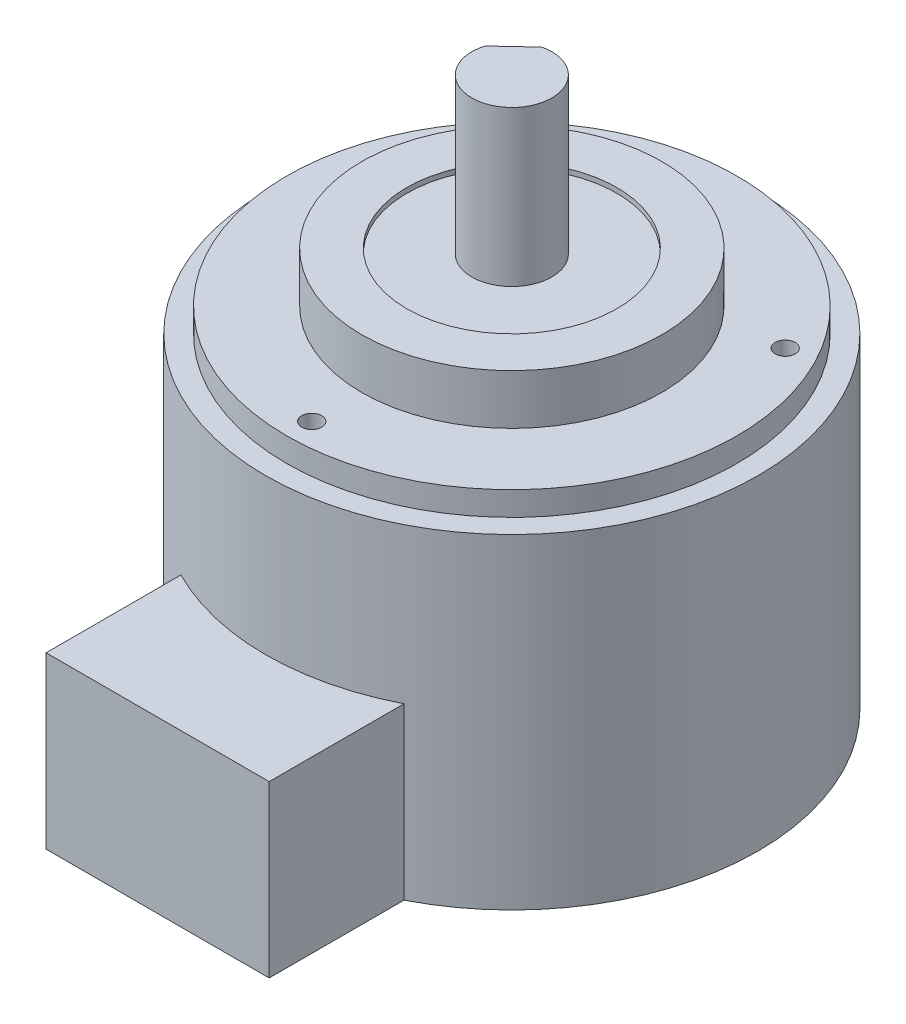
ISO-10303-21;
HEADER;
FILE_DESCRIPTION(('STEP AP214'),'2;1');
FILE_NAME('part.step','',(''),(''),'','','');
FILE_SCHEMA(('AUTOMOTIVE_DESIGN { 1 0 10303 214 1 1 1 1 }'));
ENDSEC;
DATA;
#1=APPLICATION_CONTEXT('core data for automotive mechanical design processes');
#2=APPLICATION_PROTOCOL_DEFINITION('international standard','automotive_design',2000,#1);
#3=PRODUCT_CONTEXT('',#1,'mechanical');
#4=PRODUCT('Part','Part','',(#3));
#5=PRODUCT_RELATED_PRODUCT_CATEGORY('part','',(#4));
#6=PRODUCT_DEFINITION_FORMATION('','',#4);
#7=PRODUCT_DEFINITION_CONTEXT('part definition',#1,'design');
#8=PRODUCT_DEFINITION('design','',#6,#7);
#9=PRODUCT_DEFINITION_SHAPE('','',#8);
#10=(LENGTH_UNIT() NAMED_UNIT(*) SI_UNIT(.MILLI.,.METRE.));
#11=(NAMED_UNIT(*) PLANE_ANGLE_UNIT() SI_UNIT($,.RADIAN.));
#12=(NAMED_UNIT(*) SI_UNIT($,.STERADIAN.) SOLID_ANGLE_UNIT());
#13=UNCERTAINTY_MEASURE_WITH_UNIT(LENGTH_MEASURE(1.E-05),#10,'distance_accuracy_value','');
#14=(GEOMETRIC_REPRESENTATION_CONTEXT(3) GLOBAL_UNCERTAINTY_ASSIGNED_CONTEXT((#13)) GLOBAL_UNIT_ASSIGNED_CONTEXT((#10,
#11,#12)) REPRESENTATION_CONTEXT('',''));
#15=CARTESIAN_POINT('',(0.,0.,0.));
#16=DIRECTION('',(0.,0.,1.));
#17=DIRECTION('',(1.,0.,0.));
#18=AXIS2_PLACEMENT_3D('',#15,#16,#17);
#19=CARTESIAN_POINT('',(10.5465056347778,61.8126275540008,55.6345697800967));
#20=DIRECTION('',(0.,-1.,0.));
#21=DIRECTION('',(-0.68351743738477,0.,-0.729934183876161));
#22=AXIS2_PLACEMENT_3D('',#19,#20,#21);
#23=CYLINDRICAL_SURFACE('',#22,4.);
#24=CARTESIAN_POINT('',(10.5465056347778,61.8126275540008,55.6345697800967));
#25=DIRECTION('',(0.,1.,0.));
#26=DIRECTION('',(0.68351743738477,0.,0.729934183876161));
#27=AXIS2_PLACEMENT_3D('',#24,#25,#26);
#28=CIRCLE('',#27,4.);
#29=CARTESIAN_POINT('',(6.71886340820608,61.8126275540008,54.4730384695566));
#30=VERTEX_POINT('',#29);
#31=CARTESIAN_POINT('',(9.63860014371072,61.8126275540008,51.7389687200175));
#32=VERTEX_POINT('',#31);
#33=EDGE_CURVE('P0_E11',#30,#32,#28,.T.);
#34=ORIENTED_EDGE('',*,*,#33,.F.);
#35=DIRECTION('',(0.,1.,0.));
#36=VECTOR('',#35,1.);
#37=CARTESIAN_POINT('',(6.71886340820608,51.6126275540008,54.4730384695566));
#38=LINE('',#37,#36);
#39=CARTESIAN_POINT('',(6.71886340820608,51.6126275540008,54.4730384695566));
#40=VERTEX_POINT('',#39);
#41=EDGE_CURVE('P0_E30',#40,#30,#38,.T.);
#42=ORIENTED_EDGE('',*,*,#41,.F.);
#43=CARTESIAN_POINT('',(10.5465056347778,51.6126275540008,55.6345697800967));
#44=DIRECTION('',(0.,1.,0.));
#45=DIRECTION('',(-0.68351743738477,0.,-0.729934183876161));
#46=AXIS2_PLACEMENT_3D('',#43,#44,#45);
#47=CIRCLE('',#46,4.00000000000001);
#48=CARTESIAN_POINT('',(9.63860014371072,51.6126275540008,51.7389687200175));
#49=VERTEX_POINT('',#48);
#50=EDGE_CURVE('P0_E45',#49,#40,#47,.T.);
#51=ORIENTED_EDGE('',*,*,#50,.F.);
#52=DIRECTION('',(0.,1.,0.));
#53=VECTOR('',#52,1.);
#54=CARTESIAN_POINT('',(9.63860014371072,51.6126275540008,51.7389687200175));
#55=LINE('',#54,#53);
#56=EDGE_CURVE('P0_E36',#49,#32,#55,.T.);
#57=ORIENTED_EDGE('',*,*,#56,.T.);
#58=EDGE_LOOP('',(#34,#42,#51,#57));
#59=FACE_BOUND('',#58,.T.);
#60=CARTESIAN_POINT('',(10.5465056347778,6.91262755400083,55.6345697800967));
#61=DIRECTION('',(0.,1.,0.));
#62=DIRECTION('',(0.68351743738477,0.,0.729934183876161));
#63=AXIS2_PLACEMENT_3D('',#60,#61,#62);
#64=CIRCLE('',#63,4.);
#65=CARTESIAN_POINT('',(13.2805753843169,6.91262755400083,58.5543065156014));
#66=VERTEX_POINT('',#65);
#67=EDGE_CURVE('P0_E19',#66,#66,#64,.T.);
#68=ORIENTED_EDGE('',*,*,#67,.T.);
#69=EDGE_LOOP('',(#68));
#70=FACE_BOUND('',#69,.T.);
#71=ADVANCED_FACE('P0_F16',(#59,#70),#23,.T.);
#72=CARTESIAN_POINT('',(10.5465056347778,61.8126275540008,55.6345697800967));
#73=DIRECTION('',(0.,1.,0.));
#74=DIRECTION('',(0.68351743738477,0.,0.729934183876161));
#75=AXIS2_PLACEMENT_3D('',#72,#73,#74);
#76=PLANE('',#75);
#77=DIRECTION('',(0.729934183876161,0.,-0.68351743738477));
#78=VECTOR('',#77,1.);
#79=CARTESIAN_POINT('',(6.71886340820608,61.8126275540008,54.4730384695566));
#80=LINE('',#79,#78);
#81=EDGE_CURVE('P0_E41',#30,#32,#80,.T.);
#82=ORIENTED_EDGE('',*,*,#81,.F.);
#83=ORIENTED_EDGE('',*,*,#33,.T.);
#84=EDGE_LOOP('',(#82,#83));
#85=FACE_BOUND('',#84,.T.);
#86=ADVANCED_FACE('P0_F51',(#85),#76,.T.);
#87=CARTESIAN_POINT('',(10.5465056347778,6.91262755400083,55.6345697800967));
#88=DIRECTION('',(0.,1.,0.));
#89=DIRECTION('',(0.68351743738477,0.,0.729934183876161));
#90=AXIS2_PLACEMENT_3D('',#87,#88,#89);
#91=PLANE('',#90);
#92=ORIENTED_EDGE('',*,*,#67,.F.);
#93=EDGE_LOOP('',(#92));
#94=FACE_BOUND('',#93,.T.);
#95=ADVANCED_FACE('P0_F53',(#94),#91,.F.);
#96=CARTESIAN_POINT('',(6.71886340820608,51.6126275540008,54.4730384695566));
#97=DIRECTION('',(0.68351743738477,0.,0.729934183876161));
#98=DIRECTION('',(0.729934183876161,0.,-0.68351743738477));
#99=AXIS2_PLACEMENT_3D('',#96,#97,#98);
#100=PLANE('',#99);
#101=ORIENTED_EDGE('',*,*,#81,.T.);
#102=ORIENTED_EDGE('',*,*,#56,.F.);
#103=DIRECTION('',(0.729934183876161,0.,-0.68351743738477));
#104=VECTOR('',#103,1.);
#105=CARTESIAN_POINT('',(6.71886340820608,51.6126275540008,54.4730384695566));
#106=LINE('',#105,#104);
#107=EDGE_CURVE('P0_E69',#40,#49,#106,.T.);
#108=ORIENTED_EDGE('',*,*,#107,.F.);
#109=ORIENTED_EDGE('',*,*,#41,.T.);
#110=EDGE_LOOP('',(#101,#102,#108,#109));
#111=FACE_BOUND('',#110,.T.);
#112=ADVANCED_FACE('P0_F42',(#111),#100,.F.);
#113=CARTESIAN_POINT('',(10.5465056347778,51.6126275540008,55.6345697800967));
#114=DIRECTION('',(0.,-1.,0.));
#115=DIRECTION('',(-0.68351743738477,0.,-0.729934183876161));
#116=AXIS2_PLACEMENT_3D('',#113,#114,#115);
#117=PLANE('',#116);
#118=ORIENTED_EDGE('',*,*,#50,.T.);
#119=ORIENTED_EDGE('',*,*,#107,.T.);
#120=EDGE_LOOP('',(#118,#119));
#121=FACE_BOUND('',#120,.T.);
#122=ADVANCED_FACE('P0_F64',(#121),#117,.F.);
#123=CLOSED_SHELL('',(#71,#86,#95,#112,#122));
#124=MANIFOLD_SOLID_BREP('P0_B1',#123);
#125=CARTESIAN_POINT('',(10.5465056347778,23.9126275540008,55.6345697800967));
#126=DIRECTION('',(0.,-1.,0.));
#127=DIRECTION('',(0.,0.,-1.));
#128=AXIS2_PLACEMENT_3D('',#125,#126,#127);
#129=CYLINDRICAL_SURFACE('',#128,24.6);
#130=CARTESIAN_POINT('',(10.5465056347778,6.91262755400083,55.6345697800967));
#131=DIRECTION('',(0.,1.,0.));
#132=DIRECTION('',(0.,0.,1.));
#133=AXIS2_PLACEMENT_3D('',#130,#131,#132);
#134=CIRCLE('',#133,24.6);
#135=CARTESIAN_POINT('',(-0.603494365222203,6.91262755400083,77.562576985495));
#136=VERTEX_POINT('',#135);
#137=CARTESIAN_POINT('',(21.6965056347778,6.91262755400083,77.562576985495));
#138=VERTEX_POINT('',#137);
#139=EDGE_CURVE('P1_E79',#136,#138,#134,.T.);
#140=ORIENTED_EDGE('',*,*,#139,.F.);
#141=DIRECTION('',(0.,-1.,0.));
#142=VECTOR('',#141,1.);
#143=CARTESIAN_POINT('',(-0.603494365222203,23.9126275540008,77.562576985495));
#144=LINE('',#143,#142);
#145=CARTESIAN_POINT('',(-0.603494365222203,23.9126275540008,77.562576985495));
#146=VERTEX_POINT('',#145);
#147=EDGE_CURVE('P1_E11',#146,#136,#144,.T.);
#148=ORIENTED_EDGE('',*,*,#147,.F.);
#149=CARTESIAN_POINT('',(10.5465056347778,23.9126275540008,55.6345697800967));
#150=DIRECTION('',(0.,1.,0.));
#151=DIRECTION('',(0.,0.,1.));
#152=AXIS2_PLACEMENT_3D('',#149,#150,#151);
#153=CIRCLE('',#152,24.6);
#154=CARTESIAN_POINT('',(21.6965056347778,23.9126275540008,77.562576985495));
#155=VERTEX_POINT('',#154);
#156=EDGE_CURVE('P1_E72',#146,#155,#153,.T.);
#157=ORIENTED_EDGE('',*,*,#156,.T.);
#158=DIRECTION('',(0.,-1.,0.));
#159=VECTOR('',#158,1.);
#160=CARTESIAN_POINT('',(21.6965056347778,23.9126275540008,77.562576985495));
#161=LINE('',#160,#159);
#162=EDGE_CURVE('P1_E54',#155,#138,#161,.T.);
#163=ORIENTED_EDGE('',*,*,#162,.T.);
#164=EDGE_LOOP('',(#140,#148,#157,#163));
#165=FACE_BOUND('',#164,.T.);
#166=ADVANCED_FACE('P1_F16',(#165),#129,.F.);
#167=CARTESIAN_POINT('',(-0.603494365222201,23.9126275540008,55.6345697800967));
#168=DIRECTION('',(-1.,0.,0.));
#169=DIRECTION('',(0.,0.,1.));
#170=AXIS2_PLACEMENT_3D('',#167,#168,#169);
#171=PLANE('',#170);
#172=DIRECTION('',(0.,0.,-1.));
#173=VECTOR('',#172,1.);
#174=CARTESIAN_POINT('',(-0.603494365222201,6.91262755400083,55.6345697800967));
#175=LINE('',#174,#173);
#176=CARTESIAN_POINT('',(-0.603494365222204,6.91262755400083,91.0345697800967));
#177=VERTEX_POINT('',#176);
#178=EDGE_CURVE('P1_E65',#177,#136,#175,.T.);
#179=ORIENTED_EDGE('',*,*,#178,.F.);
#180=DIRECTION('',(0.,-1.,0.));
#181=VECTOR('',#180,1.);
#182=CARTESIAN_POINT('',(-0.603494365222204,23.9126275540008,91.0345697800967));
#183=LINE('',#182,#181);
#184=CARTESIAN_POINT('',(-0.603494365222204,23.9126275540008,91.0345697800967));
#185=VERTEX_POINT('',#184);
#186=EDGE_CURVE('P1_E24',#185,#177,#183,.T.);
#187=ORIENTED_EDGE('',*,*,#186,.F.);
#188=DIRECTION('',(0.,0.,-1.));
#189=VECTOR('',#188,1.);
#190=CARTESIAN_POINT('',(-0.603494365222201,23.9126275540008,55.6345697800967));
#191=LINE('',#190,#189);
#192=EDGE_CURVE('P1_E63',#185,#146,#191,.T.);
#193=ORIENTED_EDGE('',*,*,#192,.T.);
#194=ORIENTED_EDGE('',*,*,#147,.T.);
#195=EDGE_LOOP('',(#179,#187,#193,#194));
#196=FACE_BOUND('',#195,.T.);
#197=ADVANCED_FACE('P1_F62',(#196),#171,.T.);
#198=CARTESIAN_POINT('',(10.5465056347778,23.9126275540008,91.0345697800967));
#199=DIRECTION('',(0.,0.,1.));
#200=DIRECTION('',(1.,0.,0.));
#201=AXIS2_PLACEMENT_3D('',#198,#199,#200);
#202=PLANE('',#201);
#203=DIRECTION('',(-1.,0.,0.));
#204=VECTOR('',#203,1.);
#205=CARTESIAN_POINT('',(10.5465056347778,6.91262755400083,91.0345697800967));
#206=LINE('',#205,#204);
#207=CARTESIAN_POINT('',(21.6965056347778,6.91262755400083,91.0345697800967));
#208=VERTEX_POINT('',#207);
#209=EDGE_CURVE('P1_E83',#208,#177,#206,.T.);
#210=ORIENTED_EDGE('',*,*,#209,.F.);
#211=DIRECTION('',(0.,-1.,0.));
#212=VECTOR('',#211,1.);
#213=CARTESIAN_POINT('',(21.6965056347778,23.9126275540008,91.0345697800967));
#214=LINE('',#213,#212);
#215=CARTESIAN_POINT('',(21.6965056347778,23.9126275540008,91.0345697800967));
#216=VERTEX_POINT('',#215);
#217=EDGE_CURVE('P1_E47',#216,#208,#214,.T.);
#218=ORIENTED_EDGE('',*,*,#217,.F.);
#219=DIRECTION('',(-1.,0.,0.));
#220=VECTOR('',#219,1.);
#221=CARTESIAN_POINT('',(10.5465056347778,23.9126275540008,91.0345697800967));
#222=LINE('',#221,#220);
#223=EDGE_CURVE('P1_E71',#216,#185,#222,.T.);
#224=ORIENTED_EDGE('',*,*,#223,.T.);
#225=ORIENTED_EDGE('',*,*,#186,.T.);
#226=EDGE_LOOP('',(#210,#218,#224,#225));
#227=FACE_BOUND('',#226,.T.);
#228=ADVANCED_FACE('P1_F74',(#227),#202,.T.);
#229=CARTESIAN_POINT('',(21.6965056347778,23.9126275540008,55.6345697800967));
#230=DIRECTION('',(-1.,0.,0.));
#231=DIRECTION('',(0.,0.,1.));
#232=AXIS2_PLACEMENT_3D('',#229,#230,#231);
#233=PLANE('',#232);
#234=DIRECTION('',(0.,0.,-1.));
#235=VECTOR('',#234,1.);
#236=CARTESIAN_POINT('',(21.6965056347778,6.91262755400083,55.6345697800967));
#237=LINE('',#236,#235);
#238=EDGE_CURVE('P1_E85',#208,#138,#237,.T.);
#239=ORIENTED_EDGE('',*,*,#238,.T.);
#240=ORIENTED_EDGE('',*,*,#162,.F.);
#241=DIRECTION('',(0.,0.,-1.));
#242=VECTOR('',#241,1.);
#243=CARTESIAN_POINT('',(21.6965056347778,23.9126275540008,55.6345697800967));
#244=LINE('',#243,#242);
#245=EDGE_CURVE('P1_E32',#216,#155,#244,.T.);
#246=ORIENTED_EDGE('',*,*,#245,.F.);
#247=ORIENTED_EDGE('',*,*,#217,.T.);
#248=EDGE_LOOP('',(#239,#240,#246,#247));
#249=FACE_BOUND('',#248,.T.);
#250=ADVANCED_FACE('P1_F96',(#249),#233,.F.);
#251=CARTESIAN_POINT('',(10.5465056347778,23.9126275540008,55.6345697800967));
#252=DIRECTION('',(0.,1.,0.));
#253=DIRECTION('',(0.,0.,1.));
#254=AXIS2_PLACEMENT_3D('',#251,#252,#253);
#255=PLANE('',#254);
#256=ORIENTED_EDGE('',*,*,#156,.F.);
#257=ORIENTED_EDGE('',*,*,#192,.F.);
#258=ORIENTED_EDGE('',*,*,#223,.F.);
#259=ORIENTED_EDGE('',*,*,#245,.T.);
#260=EDGE_LOOP('',(#256,#257,#258,#259));
#261=FACE_BOUND('',#260,.T.);
#262=ADVANCED_FACE('P1_F70',(#261),#255,.T.);
#263=CARTESIAN_POINT('',(10.5465056347778,6.91262755400083,55.6345697800967));
#264=DIRECTION('',(0.,1.,0.));
#265=DIRECTION('',(0.,0.,1.));
#266=AXIS2_PLACEMENT_3D('',#263,#264,#265);
#267=PLANE('',#266);
#268=ORIENTED_EDGE('',*,*,#139,.T.);
#269=ORIENTED_EDGE('',*,*,#238,.F.);
#270=ORIENTED_EDGE('',*,*,#209,.T.);
#271=ORIENTED_EDGE('',*,*,#178,.T.);
#272=EDGE_LOOP('',(#268,#269,#270,#271));
#273=FACE_BOUND('',#272,.T.);
#274=ADVANCED_FACE('P1_F101',(#273),#267,.F.);
#275=CLOSED_SHELL('',(#166,#197,#228,#250,#262,#274));
#276=MANIFOLD_SOLID_BREP('P1_B1',#275);
#277=CARTESIAN_POINT('',(10.5465056347778,39.4126275540008,55.6345697800967));
#278=DIRECTION('',(0.,-1.,0.));
#279=DIRECTION('',(0.,0.,-1.));
#280=AXIS2_PLACEMENT_3D('',#277,#278,#279);
#281=CYLINDRICAL_SURFACE('',#280,24.6);
#282=CARTESIAN_POINT('',(10.5465056347778,39.4126275540008,55.6345697800967));
#283=DIRECTION('',(0.,1.,0.));
#284=DIRECTION('',(0.,0.,1.));
#285=AXIS2_PLACEMENT_3D('',#282,#283,#284);
#286=CIRCLE('',#285,24.6);
#287=CARTESIAN_POINT('',(10.5465056347778,39.4126275540008,80.2345697800967));
#288=VERTEX_POINT('',#287);
#289=EDGE_CURVE('P2_E20',#288,#288,#286,.T.);
#290=ORIENTED_EDGE('',*,*,#289,.F.);
#291=EDGE_LOOP('',(#290));
#292=FACE_BOUND('',#291,.T.);
#293=CARTESIAN_POINT('',(10.5465056347778,6.91262755400083,55.6345697800967));
#294=DIRECTION('',(0.,1.,0.));
#295=DIRECTION('',(0.,0.,1.));
#296=AXIS2_PLACEMENT_3D('',#293,#294,#295);
#297=CIRCLE('',#296,24.6);
#298=CARTESIAN_POINT('',(10.5465056347778,6.91262755400083,80.2345697800967));
#299=VERTEX_POINT('',#298);
#300=EDGE_CURVE('P2_E29',#299,#299,#297,.T.);
#301=ORIENTED_EDGE('',*,*,#300,.T.);
#302=EDGE_LOOP('',(#301));
#303=FACE_BOUND('',#302,.T.);
#304=ADVANCED_FACE('P2_F14',(#292,#303),#281,.T.);
#305=CARTESIAN_POINT('',(10.5465056347778,39.4126275540008,55.6345697800967));
#306=DIRECTION('',(0.,1.,0.));
#307=DIRECTION('',(0.,0.,1.));
#308=AXIS2_PLACEMENT_3D('',#305,#306,#307);
#309=PLANE('',#308);
#310=CARTESIAN_POINT('',(10.5465056347778,39.4126275540008,55.6345697800967));
#311=DIRECTION('',(0.,1.,0.));
#312=DIRECTION('',(0.,0.,1.));
#313=AXIS2_PLACEMENT_3D('',#310,#311,#312);
#314=CIRCLE('',#313,22.5);
#315=CARTESIAN_POINT('',(10.5465056347778,39.4126275540008,78.1345697800967));
#316=VERTEX_POINT('',#315);
#317=EDGE_CURVE('P2_E24',#316,#316,#314,.T.);
#318=ORIENTED_EDGE('',*,*,#317,.F.);
#319=EDGE_LOOP('',(#318));
#320=FACE_BOUND('',#319,.T.);
#321=ORIENTED_EDGE('',*,*,#289,.T.);
#322=EDGE_LOOP('',(#321));
#323=FACE_BOUND('',#322,.T.);
#324=ADVANCED_FACE('P2_F115',(#320,#323),#309,.T.);
#325=CARTESIAN_POINT('',(10.5465056347778,6.91262755400083,55.6345697800967));
#326=DIRECTION('',(0.,1.,0.));
#327=DIRECTION('',(0.,0.,1.));
#328=AXIS2_PLACEMENT_3D('',#325,#326,#327);
#329=PLANE('',#328);
#330=ORIENTED_EDGE('',*,*,#300,.F.);
#331=EDGE_LOOP('',(#330));
#332=FACE_BOUND('',#331,.T.);
#333=CARTESIAN_POINT('',(10.5465056347778,6.91262755400083,55.6345697800967));
#334=DIRECTION('',(0.,1.,0.));
#335=DIRECTION('',(0.,0.,1.));
#336=AXIS2_PLACEMENT_3D('',#333,#334,#335);
#337=CIRCLE('',#336,4.);
#338=CARTESIAN_POINT('',(10.5465056347778,6.91262755400083,59.6345697800967));
#339=VERTEX_POINT('',#338);
#340=EDGE_CURVE('P2_E50',#339,#339,#337,.T.);
#341=ORIENTED_EDGE('',*,*,#340,.T.);
#342=EDGE_LOOP('',(#341));
#343=FACE_BOUND('',#342,.T.);
#344=ADVANCED_FACE('P2_F121',(#332,#343),#329,.F.);
#345=CARTESIAN_POINT('',(10.5465056347778,41.8126275540008,55.6345697800967));
#346=DIRECTION('',(0.,-1.,0.));
#347=DIRECTION('',(0.,0.,-1.));
#348=AXIS2_PLACEMENT_3D('',#345,#346,#347);
#349=CYLINDRICAL_SURFACE('',#348,22.5);
#350=ORIENTED_EDGE('',*,*,#317,.T.);
#351=EDGE_LOOP('',(#350));
#352=FACE_BOUND('',#351,.T.);
#353=CARTESIAN_POINT('',(10.5465056347778,41.8126275540008,55.6345697800967));
#354=DIRECTION('',(0.,1.,0.));
#355=DIRECTION('',(0.,0.,1.));
#356=AXIS2_PLACEMENT_3D('',#353,#354,#355);
#357=CIRCLE('',#356,22.5);
#358=CARTESIAN_POINT('',(10.5465056347778,41.8126275540008,78.1345697800967));
#359=VERTEX_POINT('',#358);
#360=EDGE_CURVE('P2_E33',#359,#359,#357,.T.);
#361=ORIENTED_EDGE('',*,*,#360,.F.);
#362=EDGE_LOOP('',(#361));
#363=FACE_BOUND('',#362,.T.);
#364=ADVANCED_FACE('P2_F87',(#352,#363),#349,.T.);
#365=CARTESIAN_POINT('',(10.5465056347778,41.8126275540008,55.6345697800967));
#366=DIRECTION('',(0.,1.,0.));
#367=DIRECTION('',(0.,0.,1.));
#368=AXIS2_PLACEMENT_3D('',#365,#366,#367);
#369=PLANE('',#368);
#370=CARTESIAN_POINT('',(27.8670137104666,41.8126275540008,45.6345697800967));
#371=DIRECTION('',(0.,1.,0.));
#372=DIRECTION('',(0.,0.,1.));
#373=AXIS2_PLACEMENT_3D('',#370,#371,#372);
#374=CIRCLE('',#373,1.);
#375=CARTESIAN_POINT('',(27.8670137104666,41.8126275540008,46.6345697800967));
#376=VERTEX_POINT('',#375);
#377=EDGE_CURVE('P2_E68',#376,#376,#374,.T.);
#378=ORIENTED_EDGE('',*,*,#377,.F.);
#379=EDGE_LOOP('',(#378));
#380=FACE_BOUND('',#379,.T.);
#381=CARTESIAN_POINT('',(-6.77400244091098,41.8126275540008,45.6345697800967));
#382=DIRECTION('',(0.,1.,0.));
#383=DIRECTION('',(0.,0.,1.));
#384=AXIS2_PLACEMENT_3D('',#381,#382,#383);
#385=CIRCLE('',#384,1.);
#386=CARTESIAN_POINT('',(-6.77400244091098,41.8126275540008,46.6345697800967));
#387=VERTEX_POINT('',#386);
#388=EDGE_CURVE('P2_E62',#387,#387,#385,.T.);
#389=ORIENTED_EDGE('',*,*,#388,.F.);
#390=EDGE_LOOP('',(#389));
#391=FACE_BOUND('',#390,.T.);
#392=CARTESIAN_POINT('',(10.5465056347778,41.8126275540008,75.6345697800967));
#393=DIRECTION('',(0.,1.,0.));
#394=DIRECTION('',(0.,0.,1.));
#395=AXIS2_PLACEMENT_3D('',#392,#393,#394);
#396=CIRCLE('',#395,1.);
#397=CARTESIAN_POINT('',(10.5465056347778,41.8126275540008,76.6345697800967));
#398=VERTEX_POINT('',#397);
#399=EDGE_CURVE('P2_E56',#398,#398,#396,.T.);
#400=ORIENTED_EDGE('',*,*,#399,.F.);
#401=EDGE_LOOP('',(#400));
#402=FACE_BOUND('',#401,.T.);
#403=CARTESIAN_POINT('',(10.5465056347778,41.8126275540008,55.6345697800967));
#404=DIRECTION('',(0.,1.,0.));
#405=DIRECTION('',(0.,0.,1.));
#406=AXIS2_PLACEMENT_3D('',#403,#404,#405);
#407=CIRCLE('',#406,15.);
#408=CARTESIAN_POINT('',(10.5465056347778,41.8126275540008,70.6345697800967));
#409=VERTEX_POINT('',#408);
#410=EDGE_CURVE('P2_E37',#409,#409,#407,.T.);
#411=ORIENTED_EDGE('',*,*,#410,.F.);
#412=EDGE_LOOP('',(#411));
#413=FACE_BOUND('',#412,.T.);
#414=ORIENTED_EDGE('',*,*,#360,.T.);
#415=EDGE_LOOP('',(#414));
#416=FACE_BOUND('',#415,.T.);
#417=ADVANCED_FACE('P2_F83',(#380,#391,#402,#413,#416),#369,.T.);
#418=CARTESIAN_POINT('',(10.5465056347778,46.8126275540008,55.6345697800967));
#419=DIRECTION('',(0.,-1.,0.));
#420=DIRECTION('',(0.,0.,-1.));
#421=AXIS2_PLACEMENT_3D('',#418,#419,#420);
#422=CYLINDRICAL_SURFACE('',#421,10.5);
#423=CARTESIAN_POINT('',(10.5465056347778,46.3126275540008,55.6345697800967));
#424=DIRECTION('',(0.,1.,0.));
#425=DIRECTION('',(0.,0.,1.));
#426=AXIS2_PLACEMENT_3D('',#423,#424,#425);
#427=CIRCLE('',#426,10.5);
#428=CARTESIAN_POINT('',(10.5465056347778,46.3126275540008,66.1345697800967));
#429=VERTEX_POINT('',#428);
#430=EDGE_CURVE('P2_E10',#429,#429,#427,.T.);
#431=ORIENTED_EDGE('',*,*,#430,.F.);
#432=EDGE_LOOP('',(#431));
#433=FACE_BOUND('',#432,.T.);
#434=CARTESIAN_POINT('',(10.5465056347778,46.8126275540008,55.6345697800967));
#435=DIRECTION('',(0.,1.,0.));
#436=DIRECTION('',(0.,0.,1.));
#437=AXIS2_PLACEMENT_3D('',#434,#435,#436);
#438=CIRCLE('',#437,10.5);
#439=CARTESIAN_POINT('',(10.5465056347778,46.8126275540008,66.1345697800967));
#440=VERTEX_POINT('',#439);
#441=EDGE_CURVE('P2_E46',#440,#440,#438,.T.);
#442=ORIENTED_EDGE('',*,*,#441,.T.);
#443=EDGE_LOOP('',(#442));
#444=FACE_BOUND('',#443,.T.);
#445=ADVANCED_FACE('P2_F86',(#433,#444),#422,.F.);
#446=CARTESIAN_POINT('',(10.5465056347778,46.8126275540008,55.6345697800967));
#447=DIRECTION('',(0.,-1.,0.));
#448=DIRECTION('',(0.,0.,-1.));
#449=AXIS2_PLACEMENT_3D('',#446,#447,#448);
#450=CYLINDRICAL_SURFACE('',#449,15.);
#451=ORIENTED_EDGE('',*,*,#410,.T.);
#452=EDGE_LOOP('',(#451));
#453=FACE_BOUND('',#452,.T.);
#454=CARTESIAN_POINT('',(10.5465056347778,46.8126275540008,55.6345697800967));
#455=DIRECTION('',(0.,1.,0.));
#456=DIRECTION('',(0.,0.,1.));
#457=AXIS2_PLACEMENT_3D('',#454,#455,#456);
#458=CIRCLE('',#457,15.);
#459=CARTESIAN_POINT('',(10.5465056347778,46.8126275540008,70.6345697800967));
#460=VERTEX_POINT('',#459);
#461=EDGE_CURVE('P2_E41',#460,#460,#458,.T.);
#462=ORIENTED_EDGE('',*,*,#461,.F.);
#463=EDGE_LOOP('',(#462));
#464=FACE_BOUND('',#463,.T.);
#465=ADVANCED_FACE('P2_F95',(#453,#464),#450,.T.);
#466=CARTESIAN_POINT('',(10.5465056347778,46.8126275540008,55.6345697800967));
#467=DIRECTION('',(0.,1.,0.));
#468=DIRECTION('',(0.,0.,1.));
#469=AXIS2_PLACEMENT_3D('',#466,#467,#468);
#470=PLANE('',#469);
#471=ORIENTED_EDGE('',*,*,#441,.F.);
#472=EDGE_LOOP('',(#471));
#473=FACE_BOUND('',#472,.T.);
#474=ORIENTED_EDGE('',*,*,#461,.T.);
#475=EDGE_LOOP('',(#474));
#476=FACE_BOUND('',#475,.T.);
#477=ADVANCED_FACE('P2_F98',(#473,#476),#470,.T.);
#478=CARTESIAN_POINT('',(10.5465056347778,46.3126275540008,55.6345697800967));
#479=DIRECTION('',(0.,-1.,0.));
#480=DIRECTION('',(0.,0.,-1.));
#481=AXIS2_PLACEMENT_3D('',#478,#479,#480);
#482=CYLINDRICAL_SURFACE('',#481,4.);
#483=CARTESIAN_POINT('',(10.5465056347778,46.3126275540008,55.6345697800967));
#484=DIRECTION('',(0.,1.,0.));
#485=DIRECTION('',(0.,0.,1.));
#486=AXIS2_PLACEMENT_3D('',#483,#484,#485);
#487=CIRCLE('',#486,4.);
#488=CARTESIAN_POINT('',(10.5465056347778,46.3126275540008,59.6345697800967));
#489=VERTEX_POINT('',#488);
#490=EDGE_CURVE('P2_E49',#489,#489,#487,.T.);
#491=ORIENTED_EDGE('',*,*,#490,.T.);
#492=EDGE_LOOP('',(#491));
#493=FACE_BOUND('',#492,.T.);
#494=ORIENTED_EDGE('',*,*,#340,.F.);
#495=EDGE_LOOP('',(#494));
#496=FACE_BOUND('',#495,.T.);
#497=ADVANCED_FACE('P2_F103',(#493,#496),#482,.F.);
#498=CARTESIAN_POINT('',(10.5465056347778,46.3126275540008,55.6345697800967));
#499=DIRECTION('',(0.,1.,0.));
#500=DIRECTION('',(0.,0.,1.));
#501=AXIS2_PLACEMENT_3D('',#498,#499,#500);
#502=PLANE('',#501);
#503=ORIENTED_EDGE('',*,*,#490,.F.);
#504=EDGE_LOOP('',(#503));
#505=FACE_BOUND('',#504,.T.);
#506=ORIENTED_EDGE('',*,*,#430,.T.);
#507=EDGE_LOOP('',(#506));
#508=FACE_BOUND('',#507,.T.);
#509=ADVANCED_FACE('P2_F110',(#505,#508),#502,.T.);
#510=CARTESIAN_POINT('',(10.5465056347778,33.8126275540008,75.6345697800967));
#511=DIRECTION('',(0.,1.,0.));
#512=DIRECTION('',(0.,0.,1.));
#513=AXIS2_PLACEMENT_3D('',#510,#511,#512);
#514=CYLINDRICAL_SURFACE('',#513,1.);
#515=CARTESIAN_POINT('',(10.5465056347778,33.8126275540008,75.6345697800967));
#516=DIRECTION('',(0.,1.,0.));
#517=DIRECTION('',(0.,0.,1.));
#518=AXIS2_PLACEMENT_3D('',#515,#516,#517);
#519=CIRCLE('',#518,1.);
#520=CARTESIAN_POINT('',(10.5465056347778,33.8126275540008,76.6345697800967));
#521=VERTEX_POINT('',#520);
#522=EDGE_CURVE('P2_E53',#521,#521,#519,.T.);
#523=ORIENTED_EDGE('',*,*,#522,.F.);
#524=EDGE_LOOP('',(#523));
#525=FACE_BOUND('',#524,.T.);
#526=ORIENTED_EDGE('',*,*,#399,.T.);
#527=EDGE_LOOP('',(#526));
#528=FACE_BOUND('',#527,.T.);
#529=ADVANCED_FACE('P2_F169',(#525,#528),#514,.F.);
#530=CARTESIAN_POINT('',(10.5465056347778,33.8126275540008,75.6345697800967));
#531=DIRECTION('',(0.,1.,0.));
#532=DIRECTION('',(0.,0.,1.));
#533=AXIS2_PLACEMENT_3D('',#530,#531,#532);
#534=PLANE('',#533);
#535=ORIENTED_EDGE('',*,*,#522,.T.);
#536=EDGE_LOOP('',(#535));
#537=FACE_BOUND('',#536,.T.);
#538=ADVANCED_FACE('P2_F179',(#537),#534,.T.);
#539=CARTESIAN_POINT('',(-6.77400244091098,33.8126275540008,45.6345697800967));
#540=DIRECTION('',(0.,1.,0.));
#541=DIRECTION('',(0.,0.,1.));
#542=AXIS2_PLACEMENT_3D('',#539,#540,#541);
#543=CYLINDRICAL_SURFACE('',#542,1.);
#544=CARTESIAN_POINT('',(-6.77400244091098,33.8126275540008,45.6345697800967));
#545=DIRECTION('',(0.,1.,0.));
#546=DIRECTION('',(0.,0.,1.));
#547=AXIS2_PLACEMENT_3D('',#544,#545,#546);
#548=CIRCLE('',#547,1.);
#549=CARTESIAN_POINT('',(-6.77400244091098,33.8126275540008,46.6345697800967));
#550=VERTEX_POINT('',#549);
#551=EDGE_CURVE('P2_E59',#550,#550,#548,.T.);
#552=ORIENTED_EDGE('',*,*,#551,.F.);
#553=EDGE_LOOP('',(#552));
#554=FACE_BOUND('',#553,.T.);
#555=ORIENTED_EDGE('',*,*,#388,.T.);
#556=EDGE_LOOP('',(#555));
#557=FACE_BOUND('',#556,.T.);
#558=ADVANCED_FACE('P2_F189',(#554,#557),#543,.F.);
#559=CARTESIAN_POINT('',(-6.77400244091098,33.8126275540008,45.6345697800967));
#560=DIRECTION('',(0.,1.,0.));
#561=DIRECTION('',(0.,0.,1.));
#562=AXIS2_PLACEMENT_3D('',#559,#560,#561);
#563=PLANE('',#562);
#564=ORIENTED_EDGE('',*,*,#551,.T.);
#565=EDGE_LOOP('',(#564));
#566=FACE_BOUND('',#565,.T.);
#567=ADVANCED_FACE('P2_F79',(#566),#563,.T.);
#568=CARTESIAN_POINT('',(27.8670137104666,33.8126275540008,45.6345697800967));
#569=DIRECTION('',(0.,1.,0.));
#570=DIRECTION('',(0.,0.,1.));
#571=AXIS2_PLACEMENT_3D('',#568,#569,#570);
#572=CYLINDRICAL_SURFACE('',#571,1.);
#573=CARTESIAN_POINT('',(27.8670137104666,33.8126275540008,45.6345697800967));
#574=DIRECTION('',(0.,1.,0.));
#575=DIRECTION('',(0.,0.,1.));
#576=AXIS2_PLACEMENT_3D('',#573,#574,#575);
#577=CIRCLE('',#576,1.);
#578=CARTESIAN_POINT('',(27.8670137104666,33.8126275540008,46.6345697800967));
#579=VERTEX_POINT('',#578);
#580=EDGE_CURVE('P2_E65',#579,#579,#577,.T.);
#581=ORIENTED_EDGE('',*,*,#580,.F.);
#582=EDGE_LOOP('',(#581));
#583=FACE_BOUND('',#582,.T.);
#584=ORIENTED_EDGE('',*,*,#377,.T.);
#585=EDGE_LOOP('',(#584));
#586=FACE_BOUND('',#585,.T.);
#587=ADVANCED_FACE('P2_F76',(#583,#586),#572,.F.);
#588=CARTESIAN_POINT('',(27.8670137104666,33.8126275540008,45.6345697800967));
#589=DIRECTION('',(0.,1.,0.));
#590=DIRECTION('',(0.,0.,1.));
#591=AXIS2_PLACEMENT_3D('',#588,#589,#590);
#592=PLANE('',#591);
#593=ORIENTED_EDGE('',*,*,#580,.T.);
#594=EDGE_LOOP('',(#593));
#595=FACE_BOUND('',#594,.T.);
#596=ADVANCED_FACE('P2_F74',(#595),#592,.T.);
#597=CLOSED_SHELL('',(#304,#324,#344,#364,#417,#445,#465,#477,#497,#509,#529,#538,#558,#567,
#587,#596));
#598=MANIFOLD_SOLID_BREP('P2_B1',#597);
#599=ADVANCED_BREP_SHAPE_REPRESENTATION('',(#18,#124,#276,#598),#14);
#600=SHAPE_DEFINITION_REPRESENTATION(#9,#599);
ENDSEC;
END-ISO-10303-21;
